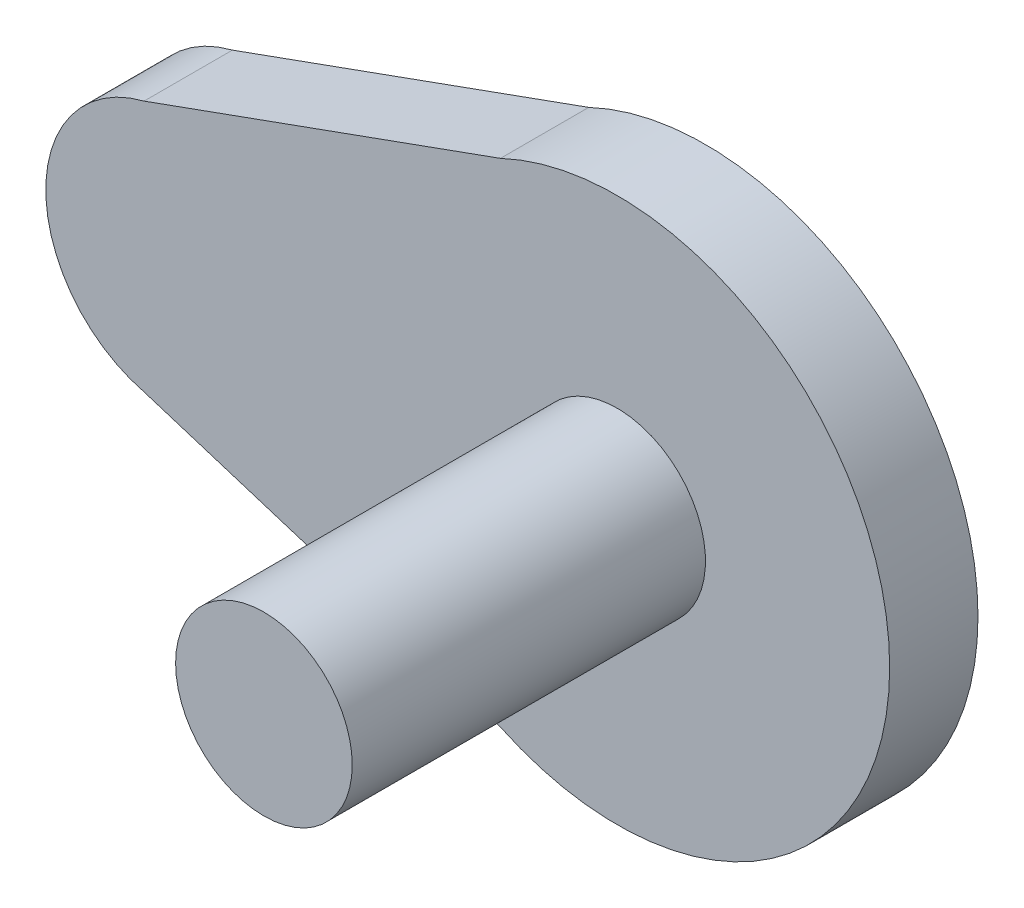
ISO-10303-21;
HEADER;
FILE_DESCRIPTION(('STEP AP214'),'2;1');
FILE_NAME('part.step','',(''),(''),'','','');
FILE_SCHEMA(('AUTOMOTIVE_DESIGN { 1 0 10303 214 1 1 1 1 }'));
ENDSEC;
DATA;
#1=APPLICATION_CONTEXT('core data for automotive mechanical design processes');
#2=APPLICATION_PROTOCOL_DEFINITION('international standard','automotive_design',2000,#1);
#3=PRODUCT_CONTEXT('',#1,'mechanical');
#4=PRODUCT('Part','Part','',(#3));
#5=PRODUCT_RELATED_PRODUCT_CATEGORY('part','',(#4));
#6=PRODUCT_DEFINITION_FORMATION('','',#4);
#7=PRODUCT_DEFINITION_CONTEXT('part definition',#1,'design');
#8=PRODUCT_DEFINITION('design','',#6,#7);
#9=PRODUCT_DEFINITION_SHAPE('','',#8);
#10=(LENGTH_UNIT() NAMED_UNIT(*) SI_UNIT(.MILLI.,.METRE.));
#11=(NAMED_UNIT(*) PLANE_ANGLE_UNIT() SI_UNIT($,.RADIAN.));
#12=(NAMED_UNIT(*) SI_UNIT($,.STERADIAN.) SOLID_ANGLE_UNIT());
#13=UNCERTAINTY_MEASURE_WITH_UNIT(LENGTH_MEASURE(1.E-05),#10,'distance_accuracy_value','');
#14=(GEOMETRIC_REPRESENTATION_CONTEXT(3) GLOBAL_UNCERTAINTY_ASSIGNED_CONTEXT((#13)) GLOBAL_UNIT_ASSIGNED_CONTEXT((#10,
#11,#12)) REPRESENTATION_CONTEXT('',''));
#15=CARTESIAN_POINT('',(0.,0.,0.));
#16=DIRECTION('',(0.,0.,1.));
#17=DIRECTION('',(1.,0.,0.));
#18=AXIS2_PLACEMENT_3D('',#15,#16,#17);
#19=CARTESIAN_POINT('',(1.78574098474349,7.1297706229168,5.));
#20=DIRECTION('',(0.,0.,-1.));
#21=DIRECTION('',(-1.,0.,0.));
#22=AXIS2_PLACEMENT_3D('',#19,#20,#21);
#23=CYLINDRICAL_SURFACE('',#22,7.35);
#24=CARTESIAN_POINT('',(1.78574098474349,7.1297706229168,0.));
#25=DIRECTION('',(0.,0.,1.));
#26=DIRECTION('',(-1.,0.,0.));
#27=AXIS2_PLACEMENT_3D('',#24,#25,#26);
#28=CIRCLE('',#27,7.35);
#29=CARTESIAN_POINT('',(0.,14.2595412458336,0.));
#30=VERTEX_POINT('',#29);
#31=CARTESIAN_POINT('',(0.,0.,0.));
#32=VERTEX_POINT('',#31);
#33=EDGE_CURVE('E106',#30,#32,#28,.T.);
#34=ORIENTED_EDGE('',*,*,#33,.T.);
#35=DIRECTION('',(0.,0.,-1.));
#36=VECTOR('',#35,1.);
#37=CARTESIAN_POINT('',(0.,0.,5.));
#38=LINE('',#37,#36);
#39=CARTESIAN_POINT('',(0.,0.,5.));
#40=VERTEX_POINT('',#39);
#41=EDGE_CURVE('E48',#40,#32,#38,.T.);
#42=ORIENTED_EDGE('',*,*,#41,.F.);
#43=CARTESIAN_POINT('',(1.78574098474349,7.1297706229168,5.));
#44=DIRECTION('',(0.,0.,1.));
#45=DIRECTION('',(-1.,0.,0.));
#46=AXIS2_PLACEMENT_3D('',#43,#44,#45);
#47=CIRCLE('',#46,7.35);
#48=CARTESIAN_POINT('',(0.,14.2595412458336,5.));
#49=VERTEX_POINT('',#48);
#50=EDGE_CURVE('E92',#49,#40,#47,.T.);
#51=ORIENTED_EDGE('',*,*,#50,.F.);
#52=DIRECTION('',(0.,0.,-1.));
#53=VECTOR('',#52,1.);
#54=CARTESIAN_POINT('',(0.,14.2595412458336,5.));
#55=LINE('',#54,#53);
#56=EDGE_CURVE('E102',#49,#30,#55,.T.);
#57=ORIENTED_EDGE('',*,*,#56,.T.);
#58=EDGE_LOOP('',(#34,#42,#51,#57));
#59=FACE_BOUND('',#58,.T.);
#60=ADVANCED_FACE('F40',(#59),#23,.T.);
#61=CARTESIAN_POINT('',(0.,0.,5.));
#62=DIRECTION('',(0.300027685235902,0.953930494371569,0.));
#63=DIRECTION('',(-0.953930494371569,0.300027685235902,0.));
#64=AXIS2_PLACEMENT_3D('',#61,#62,#63);
#65=PLANE('',#64);
#66=DIRECTION('',(0.953930494371569,-0.300027685235902,0.));
#67=VECTOR('',#66,1.);
#68=CARTESIAN_POINT('',(0.,0.,0.));
#69=LINE('',#68,#67);
#70=CARTESIAN_POINT('',(20.176972808942,-6.34600789329271,0.));
#71=VERTEX_POINT('',#70);
#72=EDGE_CURVE('E97',#32,#71,#69,.T.);
#73=ORIENTED_EDGE('',*,*,#72,.T.);
#74=DIRECTION('',(0.,0.,-1.));
#75=VECTOR('',#74,1.);
#76=CARTESIAN_POINT('',(20.176972808942,-6.34600789329271,5.));
#77=LINE('',#76,#75);
#78=CARTESIAN_POINT('',(20.176972808942,-6.34600789329271,5.));
#79=VERTEX_POINT('',#78);
#80=EDGE_CURVE('E95',#79,#71,#77,.T.);
#81=ORIENTED_EDGE('',*,*,#80,.F.);
#82=DIRECTION('',(0.953930494371569,-0.300027685235902,0.));
#83=VECTOR('',#82,1.);
#84=CARTESIAN_POINT('',(0.,0.,5.));
#85=LINE('',#84,#83);
#86=EDGE_CURVE('E87',#40,#79,#85,.T.);
#87=ORIENTED_EDGE('',*,*,#86,.F.);
#88=ORIENTED_EDGE('',*,*,#41,.T.);
#89=EDGE_LOOP('',(#73,#81,#87,#88));
#90=FACE_BOUND('',#89,.T.);
#91=ADVANCED_FACE('F96',(#90),#65,.F.);
#92=CARTESIAN_POINT('',(26.7857409847435,7.59705788143965,5.));
#93=DIRECTION('',(0.,0.,-1.));
#94=DIRECTION('',(-1.,0.,0.));
#95=AXIS2_PLACEMENT_3D('',#92,#93,#94);
#96=CYLINDRICAL_SURFACE('',#95,15.43);
#97=CARTESIAN_POINT('',(26.7857409847435,7.59705788143965,0.));
#98=DIRECTION('',(0.,0.,1.));
#99=DIRECTION('',(1.,0.,0.));
#100=AXIS2_PLACEMENT_3D('',#97,#98,#99);
#101=CIRCLE('',#100,15.43);
#102=CARTESIAN_POINT('',(20.176972808942,21.540123656172,0.));
#103=VERTEX_POINT('',#102);
#104=EDGE_CURVE('E73',#71,#103,#101,.T.);
#105=ORIENTED_EDGE('',*,*,#104,.T.);
#106=DIRECTION('',(0.,0.,-1.));
#107=VECTOR('',#106,1.);
#108=CARTESIAN_POINT('',(20.176972808942,21.540123656172,5.));
#109=LINE('',#108,#107);
#110=CARTESIAN_POINT('',(20.176972808942,21.540123656172,5.));
#111=VERTEX_POINT('',#110);
#112=EDGE_CURVE('E98',#111,#103,#109,.T.);
#113=ORIENTED_EDGE('',*,*,#112,.F.);
#114=CARTESIAN_POINT('',(26.7857409847435,7.59705788143965,5.));
#115=DIRECTION('',(0.,0.,1.));
#116=DIRECTION('',(1.,0.,0.));
#117=AXIS2_PLACEMENT_3D('',#114,#115,#116);
#118=CIRCLE('',#117,15.43);
#119=EDGE_CURVE('E90',#79,#111,#118,.T.);
#120=ORIENTED_EDGE('',*,*,#119,.F.);
#121=ORIENTED_EDGE('',*,*,#80,.T.);
#122=EDGE_LOOP('',(#105,#113,#120,#121));
#123=FACE_BOUND('',#122,.T.);
#124=ADVANCED_FACE('F100',(#123),#96,.T.);
#125=CARTESIAN_POINT('',(0.,14.2595412458336,5.));
#126=DIRECTION('',(0.339415701840378,-0.940636476724247,0.));
#127=DIRECTION('',(0.940636476724246,0.339415701840378,0.));
#128=AXIS2_PLACEMENT_3D('',#125,#126,#127);
#129=PLANE('',#128);
#130=DIRECTION('',(-0.940636476724247,-0.339415701840378,0.));
#131=VECTOR('',#130,1.);
#132=CARTESIAN_POINT('',(0.,14.2595412458336,0.));
#133=LINE('',#132,#131);
#134=EDGE_CURVE('E79',#103,#30,#133,.T.);
#135=ORIENTED_EDGE('',*,*,#134,.T.);
#136=ORIENTED_EDGE('',*,*,#56,.F.);
#137=DIRECTION('',(-0.940636476724247,-0.339415701840378,0.));
#138=VECTOR('',#137,1.);
#139=CARTESIAN_POINT('',(0.,14.2595412458336,5.));
#140=LINE('',#139,#138);
#141=EDGE_CURVE('E56',#111,#49,#140,.T.);
#142=ORIENTED_EDGE('',*,*,#141,.F.);
#143=ORIENTED_EDGE('',*,*,#112,.T.);
#144=EDGE_LOOP('',(#135,#136,#142,#143));
#145=FACE_BOUND('',#144,.T.);
#146=ADVANCED_FACE('F129',(#145),#129,.F.);
#147=CARTESIAN_POINT('',(1.78574098474349,7.1297706229168,5.));
#148=DIRECTION('',(0.,0.,-1.));
#149=DIRECTION('',(-1.,0.,0.));
#150=AXIS2_PLACEMENT_3D('',#147,#148,#149);
#151=PLANE('',#150);
#152=CARTESIAN_POINT('',(26.7857409847435,7.59705788143965,5.));
#153=DIRECTION('',(0.,0.,-1.));
#154=DIRECTION('',(-1.,0.,0.));
#155=AXIS2_PLACEMENT_3D('',#152,#153,#154);
#156=CIRCLE('',#155,5.);
#157=CARTESIAN_POINT('',(21.7857409847435,7.59705788143965,5.));
#158=VERTEX_POINT('',#157);
#159=EDGE_CURVE('E11',#158,#158,#156,.F.);
#160=ORIENTED_EDGE('',*,*,#159,.F.);
#161=EDGE_LOOP('',(#160));
#162=FACE_BOUND('',#161,.T.);
#163=ORIENTED_EDGE('',*,*,#50,.T.);
#164=ORIENTED_EDGE('',*,*,#86,.T.);
#165=ORIENTED_EDGE('',*,*,#119,.T.);
#166=ORIENTED_EDGE('',*,*,#141,.T.);
#167=EDGE_LOOP('',(#163,#164,#165,#166));
#168=FACE_BOUND('',#167,.T.);
#169=ADVANCED_FACE('F88',(#162,#168),#151,.F.);
#170=CARTESIAN_POINT('',(1.78574098474349,7.1297706229168,0.));
#171=DIRECTION('',(0.,0.,-1.));
#172=DIRECTION('',(-1.,0.,0.));
#173=AXIS2_PLACEMENT_3D('',#170,#171,#172);
#174=PLANE('',#173);
#175=CARTESIAN_POINT('',(1.78574098474349,7.1297706229168,0.));
#176=DIRECTION('',(0.,0.,-1.));
#177=DIRECTION('',(-1.,0.,0.));
#178=AXIS2_PLACEMENT_3D('',#175,#176,#177);
#179=CIRCLE('',#178,2.5);
#180=CARTESIAN_POINT('',(-0.714259015256511,7.1297706229168,0.));
#181=VERTEX_POINT('',#180);
#182=EDGE_CURVE('E231',#181,#181,#179,.T.);
#183=ORIENTED_EDGE('',*,*,#182,.F.);
#184=EDGE_LOOP('',(#183));
#185=FACE_BOUND('',#184,.T.);
#186=ORIENTED_EDGE('',*,*,#33,.F.);
#187=ORIENTED_EDGE('',*,*,#134,.F.);
#188=ORIENTED_EDGE('',*,*,#104,.F.);
#189=ORIENTED_EDGE('',*,*,#72,.F.);
#190=EDGE_LOOP('',(#186,#187,#188,#189));
#191=FACE_BOUND('',#190,.T.);
#192=ADVANCED_FACE('F117',(#185,#191),#174,.T.);
#193=CARTESIAN_POINT('',(26.7857409847435,7.59705788143965,25.));
#194=DIRECTION('',(0.,0.,-1.));
#195=DIRECTION('',(-1.,0.,0.));
#196=AXIS2_PLACEMENT_3D('',#193,#194,#195);
#197=CYLINDRICAL_SURFACE('',#196,5.);
#198=CARTESIAN_POINT('',(26.7857409847435,7.59705788143965,25.));
#199=DIRECTION('',(0.,0.,1.));
#200=DIRECTION('',(1.,0.,0.));
#201=AXIS2_PLACEMENT_3D('',#198,#199,#200);
#202=CIRCLE('',#201,5.);
#203=CARTESIAN_POINT('',(31.7857409847435,7.59705788143965,25.));
#204=VERTEX_POINT('',#203);
#205=EDGE_CURVE('E109',#204,#204,#202,.T.);
#206=ORIENTED_EDGE('',*,*,#205,.F.);
#207=EDGE_LOOP('',(#206));
#208=FACE_BOUND('',#207,.T.);
#209=ORIENTED_EDGE('',*,*,#159,.T.);
#210=EDGE_LOOP('',(#209));
#211=FACE_BOUND('',#210,.T.);
#212=ADVANCED_FACE('F119',(#208,#211),#197,.T.);
#213=CARTESIAN_POINT('',(26.7857409847435,7.59705788143965,25.));
#214=DIRECTION('',(0.,0.,1.));
#215=DIRECTION('',(1.,0.,0.));
#216=AXIS2_PLACEMENT_3D('',#213,#214,#215);
#217=PLANE('',#216);
#218=ORIENTED_EDGE('',*,*,#205,.T.);
#219=EDGE_LOOP('',(#218));
#220=FACE_BOUND('',#219,.T.);
#221=ADVANCED_FACE('F126',(#220),#217,.T.);
#222=CARTESIAN_POINT('',(1.78574098474349,7.1297706229168,-5.));
#223=DIRECTION('',(0.,0.,1.));
#224=DIRECTION('',(1.,0.,0.));
#225=AXIS2_PLACEMENT_3D('',#222,#223,#224);
#226=CYLINDRICAL_SURFACE('',#225,2.5);
#227=CARTESIAN_POINT('',(1.78574098474349,7.1297706229168,-5.));
#228=DIRECTION('',(0.,0.,-1.));
#229=DIRECTION('',(-1.,0.,0.));
#230=AXIS2_PLACEMENT_3D('',#227,#228,#229);
#231=CIRCLE('',#230,2.5);
#232=CARTESIAN_POINT('',(-0.714259015256511,7.1297706229168,-5.));
#233=VERTEX_POINT('',#232);
#234=EDGE_CURVE('E230',#233,#233,#231,.T.);
#235=ORIENTED_EDGE('',*,*,#234,.F.);
#236=EDGE_LOOP('',(#235));
#237=FACE_BOUND('',#236,.T.);
#238=ORIENTED_EDGE('',*,*,#182,.T.);
#239=EDGE_LOOP('',(#238));
#240=FACE_BOUND('',#239,.T.);
#241=ADVANCED_FACE('F168',(#237,#240),#226,.T.);
#242=CARTESIAN_POINT('',(1.78574098474349,7.1297706229168,-5.));
#243=DIRECTION('',(0.,0.,-1.));
#244=DIRECTION('',(-1.,0.,0.));
#245=AXIS2_PLACEMENT_3D('',#242,#243,#244);
#246=PLANE('',#245);
#247=ORIENTED_EDGE('',*,*,#234,.T.);
#248=EDGE_LOOP('',(#247));
#249=FACE_BOUND('',#248,.T.);
#250=ADVANCED_FACE('F184',(#249),#246,.T.);
#251=CLOSED_SHELL('',(#60,#91,#124,#146,#169,#192,#212,#221,#241,#250));
#252=MANIFOLD_SOLID_BREP('B2',#251);
#253=ADVANCED_BREP_SHAPE_REPRESENTATION('',(#18,#252),#14);
#254=SHAPE_DEFINITION_REPRESENTATION(#9,#253);
ENDSEC;
END-ISO-10303-21;
